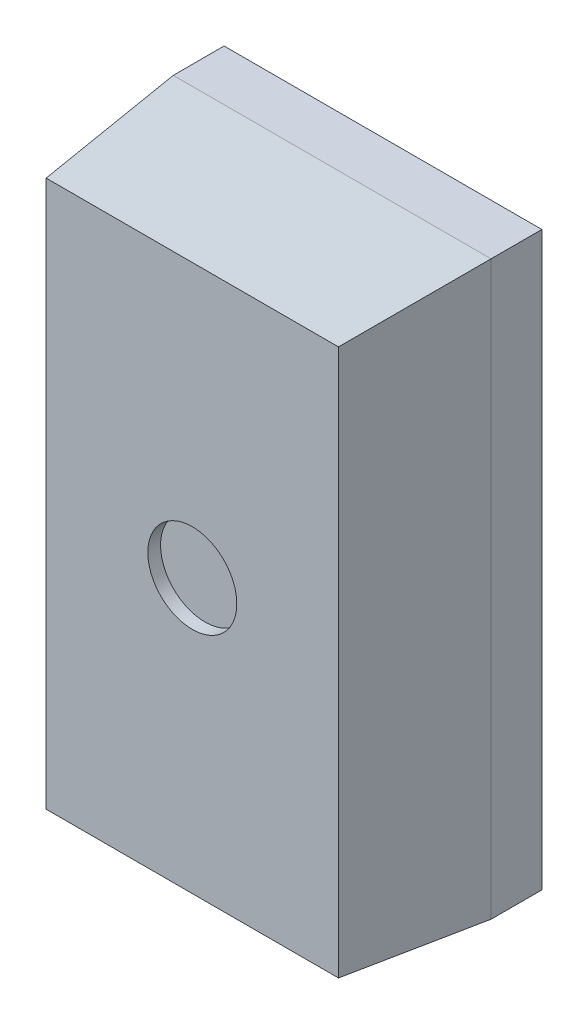
ISO-10303-21;
HEADER;
FILE_DESCRIPTION(('STEP AP214'),'2;1');
FILE_NAME('part.step','',(''),(''),'','','');
FILE_SCHEMA(('AUTOMOTIVE_DESIGN { 1 0 10303 214 1 1 1 1 }'));
ENDSEC;
DATA;
#1=APPLICATION_CONTEXT('core data for automotive mechanical design processes');
#2=APPLICATION_PROTOCOL_DEFINITION('international standard','automotive_design',2000,#1);
#3=PRODUCT_CONTEXT('',#1,'mechanical');
#4=PRODUCT('Part','Part','',(#3));
#5=PRODUCT_RELATED_PRODUCT_CATEGORY('part','',(#4));
#6=PRODUCT_DEFINITION_FORMATION('','',#4);
#7=PRODUCT_DEFINITION_CONTEXT('part definition',#1,'design');
#8=PRODUCT_DEFINITION('design','',#6,#7);
#9=PRODUCT_DEFINITION_SHAPE('','',#8);
#10=(LENGTH_UNIT() NAMED_UNIT(*) SI_UNIT(.MILLI.,.METRE.));
#11=(NAMED_UNIT(*) PLANE_ANGLE_UNIT() SI_UNIT($,.RADIAN.));
#12=(NAMED_UNIT(*) SI_UNIT($,.STERADIAN.) SOLID_ANGLE_UNIT());
#13=UNCERTAINTY_MEASURE_WITH_UNIT(LENGTH_MEASURE(1.E-05),#10,'distance_accuracy_value','');
#14=(GEOMETRIC_REPRESENTATION_CONTEXT(3) GLOBAL_UNCERTAINTY_ASSIGNED_CONTEXT((#13)) GLOBAL_UNIT_ASSIGNED_CONTEXT((#10,
#11,#12)) REPRESENTATION_CONTEXT('',''));
#15=CARTESIAN_POINT('',(0.,0.,0.));
#16=DIRECTION('',(0.,0.,1.));
#17=DIRECTION('',(1.,0.,0.));
#18=AXIS2_PLACEMENT_3D('',#15,#16,#17);
#19=CARTESIAN_POINT('',(0.,0.,1.42));
#20=DIRECTION('',(0.,0.,-1.));
#21=DIRECTION('',(-1.,0.,0.));
#22=AXIS2_PLACEMENT_3D('',#19,#20,#21);
#23=PLANE('',#22);
#24=CARTESIAN_POINT('',(0.,0.,1.42));
#25=DIRECTION('',(0.,0.,-1.));
#26=DIRECTION('',(-1.,0.,0.));
#27=AXIS2_PLACEMENT_3D('',#24,#25,#26);
#28=CIRCLE('',#27,0.35);
#29=CARTESIAN_POINT('',(-0.35,0.,1.42));
#30=VERTEX_POINT('',#29);
#31=EDGE_CURVE('E20',#30,#30,#28,.F.);
#32=ORIENTED_EDGE('',*,*,#31,.T.);
#33=EDGE_LOOP('',(#32));
#34=FACE_BOUND('',#33,.T.);
#35=ADVANCED_FACE('F17',(#34),#23,.F.);
#36=CARTESIAN_POINT('',(0.,0.,1.52));
#37=DIRECTION('',(0.,0.,-1.));
#38=DIRECTION('',(-1.,0.,0.));
#39=AXIS2_PLACEMENT_3D('',#36,#37,#38);
#40=CYLINDRICAL_SURFACE('',#39,0.35);
#41=CARTESIAN_POINT('',(0.,0.,1.52));
#42=DIRECTION('',(0.,0.,-1.));
#43=DIRECTION('',(-1.,0.,0.));
#44=AXIS2_PLACEMENT_3D('',#41,#42,#43);
#45=CIRCLE('',#44,0.35);
#46=CARTESIAN_POINT('',(-0.35,0.,1.52));
#47=VERTEX_POINT('',#46);
#48=EDGE_CURVE('E89',#47,#47,#45,.T.);
#49=ORIENTED_EDGE('',*,*,#48,.F.);
#50=EDGE_LOOP('',(#49));
#51=FACE_BOUND('',#50,.T.);
#52=ORIENTED_EDGE('',*,*,#31,.F.);
#53=EDGE_LOOP('',(#52));
#54=FACE_BOUND('',#53,.T.);
#55=ADVANCED_FACE('F104',(#51,#54),#40,.F.);
#56=CARTESIAN_POINT('',(0.,0.,1.52));
#57=DIRECTION('',(0.,0.,1.));
#58=DIRECTION('',(1.,0.,0.));
#59=AXIS2_PLACEMENT_3D('',#56,#57,#58);
#60=PLANE('',#59);
#61=ORIENTED_EDGE('',*,*,#48,.T.);
#62=EDGE_LOOP('',(#61));
#63=FACE_BOUND('',#62,.T.);
#64=DIRECTION('',(1.,0.,0.));
#65=VECTOR('',#64,1.);
#66=CARTESIAN_POINT('',(1.25,2.15000000000003,1.52));
#67=LINE('',#66,#65);
#68=CARTESIAN_POINT('',(1.15000000000001,2.15000000000001,1.52));
#69=VERTEX_POINT('',#68);
#70=CARTESIAN_POINT('',(-1.15000000000001,2.15000000000001,1.52));
#71=VERTEX_POINT('',#70);
#72=EDGE_CURVE('E67',#69,#71,#67,.F.);
#73=ORIENTED_EDGE('',*,*,#72,.T.);
#74=DIRECTION('',(0.,1.,0.));
#75=VECTOR('',#74,1.);
#76=CARTESIAN_POINT('',(-1.15000000000003,2.25,1.52));
#77=LINE('',#76,#75);
#78=CARTESIAN_POINT('',(-1.15000000000001,-2.15000000000001,1.52));
#79=VERTEX_POINT('',#78);
#80=EDGE_CURVE('E85',#71,#79,#77,.F.);
#81=ORIENTED_EDGE('',*,*,#80,.T.);
#82=DIRECTION('',(1.,0.,0.));
#83=VECTOR('',#82,1.);
#84=CARTESIAN_POINT('',(-1.25,-2.15000000000003,1.52));
#85=LINE('',#84,#83);
#86=CARTESIAN_POINT('',(1.15000000000001,-2.15000000000001,1.52));
#87=VERTEX_POINT('',#86);
#88=EDGE_CURVE('E81',#79,#87,#85,.T.);
#89=ORIENTED_EDGE('',*,*,#88,.T.);
#90=DIRECTION('',(0.,1.,0.));
#91=VECTOR('',#90,1.);
#92=CARTESIAN_POINT('',(1.15000000000003,-2.25,1.52));
#93=LINE('',#92,#91);
#94=EDGE_CURVE('E72',#87,#69,#93,.T.);
#95=ORIENTED_EDGE('',*,*,#94,.T.);
#96=EDGE_LOOP('',(#73,#81,#89,#95));
#97=FACE_BOUND('',#96,.T.);
#98=ADVANCED_FACE('F84',(#63,#97),#60,.T.);
#99=CARTESIAN_POINT('',(-1.25,-2.2,0.97));
#100=DIRECTION('',(0.,0.995893206467709,-0.0905357460424635));
#101=DIRECTION('',(0.,0.0905357460424635,0.995893206467709));
#102=AXIS2_PLACEMENT_3D('',#99,#100,#101);
#103=PLANE('',#102);
#104=DIRECTION('',(1.,0.,0.));
#105=VECTOR('',#104,1.);
#106=CARTESIAN_POINT('',(-1.25,-2.25,0.42));
#107=LINE('',#106,#105);
#108=CARTESIAN_POINT('',(-1.24999999999999,-2.24999999999998,0.419999999999998));
#109=VERTEX_POINT('',#108);
#110=CARTESIAN_POINT('',(1.25,-2.24999999999998,0.419999999999998));
#111=VERTEX_POINT('',#110);
#112=EDGE_CURVE('E92',#109,#111,#107,.T.);
#113=ORIENTED_EDGE('',*,*,#112,.T.);
#114=DIRECTION('',(-0.0901669634666883,0.0901669634667435,0.99183659813418));
#115=VECTOR('',#114,1.);
#116=CARTESIAN_POINT('',(1.24999999999997,-2.25,0.419999999999997));
#117=LINE('',#116,#115);
#118=EDGE_CURVE('E77',#111,#87,#117,.T.);
#119=ORIENTED_EDGE('',*,*,#118,.T.);
#120=ORIENTED_EDGE('',*,*,#88,.F.);
#121=DIRECTION('',(-0.0901669634666883,-0.0901669634667435,-0.99183659813418));
#122=VECTOR('',#121,1.);
#123=CARTESIAN_POINT('',(-1.15000000000003,-2.15,1.52));
#124=LINE('',#123,#122);
#125=EDGE_CURVE('E246',#79,#109,#124,.T.);
#126=ORIENTED_EDGE('',*,*,#125,.T.);
#127=EDGE_LOOP('',(#113,#119,#120,#126));
#128=FACE_BOUND('',#127,.T.);
#129=ADVANCED_FACE('F91',(#128),#103,.F.);
#130=CARTESIAN_POINT('',(1.2,-2.25,0.97));
#131=DIRECTION('',(-0.995893206467709,0.,-0.0905357460424635));
#132=DIRECTION('',(-0.0905357460424635,0.,0.995893206467709));
#133=AXIS2_PLACEMENT_3D('',#130,#131,#132);
#134=PLANE('',#133);
#135=DIRECTION('',(0.,1.,0.));
#136=VECTOR('',#135,1.);
#137=CARTESIAN_POINT('',(1.25,-2.25,0.42));
#138=LINE('',#137,#136);
#139=CARTESIAN_POINT('',(1.24999999999998,2.25,0.419999999999998));
#140=VERTEX_POINT('',#139);
#141=EDGE_CURVE('E239',#111,#140,#138,.T.);
#142=ORIENTED_EDGE('',*,*,#141,.T.);
#143=DIRECTION('',(-0.0901669634667432,-0.0901669634666887,0.99183659813418));
#144=VECTOR('',#143,1.);
#145=CARTESIAN_POINT('',(1.25,2.24999999999997,0.419999999999997));
#146=LINE('',#145,#144);
#147=EDGE_CURVE('E79',#140,#69,#146,.T.);
#148=ORIENTED_EDGE('',*,*,#147,.T.);
#149=ORIENTED_EDGE('',*,*,#94,.F.);
#150=ORIENTED_EDGE('',*,*,#118,.F.);
#151=EDGE_LOOP('',(#142,#148,#149,#150));
#152=FACE_BOUND('',#151,.T.);
#153=ADVANCED_FACE('F75',(#152),#134,.F.);
#154=CARTESIAN_POINT('',(1.25,2.2,0.97));
#155=DIRECTION('',(0.,-0.995893206467709,-0.0905357460424635));
#156=DIRECTION('',(0.,0.0905357460424635,-0.995893206467709));
#157=AXIS2_PLACEMENT_3D('',#154,#155,#156);
#158=PLANE('',#157);
#159=DIRECTION('',(1.,0.,0.));
#160=VECTOR('',#159,1.);
#161=CARTESIAN_POINT('',(1.25,2.25,0.42));
#162=LINE('',#161,#160);
#163=CARTESIAN_POINT('',(-1.25,2.24999999999998,0.419999999999998));
#164=VERTEX_POINT('',#163);
#165=EDGE_CURVE('E223',#140,#164,#162,.F.);
#166=ORIENTED_EDGE('',*,*,#165,.T.);
#167=DIRECTION('',(0.0901669634666883,-0.0901669634667435,0.99183659813418));
#168=VECTOR('',#167,1.);
#169=CARTESIAN_POINT('',(-1.24999999999997,2.25,0.419999999999997));
#170=LINE('',#169,#168);
#171=EDGE_CURVE('E224',#164,#71,#170,.T.);
#172=ORIENTED_EDGE('',*,*,#171,.T.);
#173=ORIENTED_EDGE('',*,*,#72,.F.);
#174=ORIENTED_EDGE('',*,*,#147,.F.);
#175=EDGE_LOOP('',(#166,#172,#173,#174));
#176=FACE_BOUND('',#175,.T.);
#177=ADVANCED_FACE('F139',(#176),#158,.F.);
#178=CARTESIAN_POINT('',(-1.2,2.25,0.97));
#179=DIRECTION('',(0.995893206467709,0.,-0.0905357460424635));
#180=DIRECTION('',(-0.0905357460424635,0.,-0.995893206467709));
#181=AXIS2_PLACEMENT_3D('',#178,#179,#180);
#182=PLANE('',#181);
#183=DIRECTION('',(0.,1.,0.));
#184=VECTOR('',#183,1.);
#185=CARTESIAN_POINT('',(-1.25,2.25,0.42));
#186=LINE('',#185,#184);
#187=EDGE_CURVE('E230',#164,#109,#186,.F.);
#188=ORIENTED_EDGE('',*,*,#187,.T.);
#189=ORIENTED_EDGE('',*,*,#125,.F.);
#190=ORIENTED_EDGE('',*,*,#80,.F.);
#191=ORIENTED_EDGE('',*,*,#171,.F.);
#192=EDGE_LOOP('',(#188,#189,#190,#191));
#193=FACE_BOUND('',#192,.T.);
#194=ADVANCED_FACE('F135',(#193),#182,.F.);
#195=CARTESIAN_POINT('',(-1.25,-2.25,0.02));
#196=DIRECTION('',(0.,1.,0.));
#197=DIRECTION('',(0.,0.,1.));
#198=AXIS2_PLACEMENT_3D('',#195,#196,#197);
#199=PLANE('',#198);
#200=DIRECTION('',(0.,0.,1.));
#201=VECTOR('',#200,1.);
#202=CARTESIAN_POINT('',(1.25,-2.25,0.02));
#203=LINE('',#202,#201);
#204=CARTESIAN_POINT('',(1.25,-2.25,0.02));
#205=VERTEX_POINT('',#204);
#206=EDGE_CURVE('E241',#205,#111,#203,.T.);
#207=ORIENTED_EDGE('',*,*,#206,.T.);
#208=ORIENTED_EDGE('',*,*,#112,.F.);
#209=DIRECTION('',(0.,0.,-1.));
#210=VECTOR('',#209,1.);
#211=CARTESIAN_POINT('',(-1.25,-2.25,0.02));
#212=LINE('',#211,#210);
#213=CARTESIAN_POINT('',(-1.25,-2.25,0.02));
#214=VERTEX_POINT('',#213);
#215=EDGE_CURVE('E232',#109,#214,#212,.T.);
#216=ORIENTED_EDGE('',*,*,#215,.T.);
#217=DIRECTION('',(1.,0.,0.));
#218=VECTOR('',#217,1.);
#219=CARTESIAN_POINT('',(0.,-2.25,0.02));
#220=LINE('',#219,#218);
#221=EDGE_CURVE('E249',#214,#205,#220,.T.);
#222=ORIENTED_EDGE('',*,*,#221,.T.);
#223=EDGE_LOOP('',(#207,#208,#216,#222));
#224=FACE_BOUND('',#223,.T.);
#225=ADVANCED_FACE('F131',(#224),#199,.F.);
#226=CARTESIAN_POINT('',(1.25,-2.25,0.02));
#227=DIRECTION('',(-1.,0.,0.));
#228=DIRECTION('',(0.,0.,1.));
#229=AXIS2_PLACEMENT_3D('',#226,#227,#228);
#230=PLANE('',#229);
#231=DIRECTION('',(0.,0.,-1.));
#232=VECTOR('',#231,1.);
#233=CARTESIAN_POINT('',(1.25,2.25,0.02));
#234=LINE('',#233,#232);
#235=CARTESIAN_POINT('',(1.25,2.25,0.02));
#236=VERTEX_POINT('',#235);
#237=EDGE_CURVE('E226',#236,#140,#234,.F.);
#238=ORIENTED_EDGE('',*,*,#237,.T.);
#239=ORIENTED_EDGE('',*,*,#141,.F.);
#240=ORIENTED_EDGE('',*,*,#206,.F.);
#241=DIRECTION('',(0.,1.,0.));
#242=VECTOR('',#241,1.);
#243=CARTESIAN_POINT('',(1.25,0.,0.02));
#244=LINE('',#243,#242);
#245=EDGE_CURVE('E252',#205,#236,#244,.T.);
#246=ORIENTED_EDGE('',*,*,#245,.T.);
#247=EDGE_LOOP('',(#238,#239,#240,#246));
#248=FACE_BOUND('',#247,.T.);
#249=ADVANCED_FACE('F127',(#248),#230,.F.);
#250=CARTESIAN_POINT('',(1.25,2.25,0.02));
#251=DIRECTION('',(0.,-1.,0.));
#252=DIRECTION('',(0.,0.,-1.));
#253=AXIS2_PLACEMENT_3D('',#250,#251,#252);
#254=PLANE('',#253);
#255=DIRECTION('',(0.,0.,-1.));
#256=VECTOR('',#255,1.);
#257=CARTESIAN_POINT('',(-1.25,2.25,0.02));
#258=LINE('',#257,#256);
#259=CARTESIAN_POINT('',(-1.25,2.25,0.02));
#260=VERTEX_POINT('',#259);
#261=EDGE_CURVE('E34',#260,#164,#258,.F.);
#262=ORIENTED_EDGE('',*,*,#261,.T.);
#263=ORIENTED_EDGE('',*,*,#165,.F.);
#264=ORIENTED_EDGE('',*,*,#237,.F.);
#265=DIRECTION('',(1.,0.,0.));
#266=VECTOR('',#265,1.);
#267=CARTESIAN_POINT('',(0.,2.25,0.02));
#268=LINE('',#267,#266);
#269=EDGE_CURVE('E26',#236,#260,#268,.F.);
#270=ORIENTED_EDGE('',*,*,#269,.T.);
#271=EDGE_LOOP('',(#262,#263,#264,#270));
#272=FACE_BOUND('',#271,.T.);
#273=ADVANCED_FACE('F121',(#272),#254,.F.);
#274=CARTESIAN_POINT('',(-1.25,2.25,0.02));
#275=DIRECTION('',(1.,0.,0.));
#276=DIRECTION('',(0.,0.,-1.));
#277=AXIS2_PLACEMENT_3D('',#274,#275,#276);
#278=PLANE('',#277);
#279=ORIENTED_EDGE('',*,*,#215,.F.);
#280=ORIENTED_EDGE('',*,*,#187,.F.);
#281=ORIENTED_EDGE('',*,*,#261,.F.);
#282=DIRECTION('',(0.,1.,0.));
#283=VECTOR('',#282,1.);
#284=CARTESIAN_POINT('',(-1.25,0.,0.02));
#285=LINE('',#284,#283);
#286=EDGE_CURVE('E11',#260,#214,#285,.F.);
#287=ORIENTED_EDGE('',*,*,#286,.T.);
#288=EDGE_LOOP('',(#279,#280,#281,#287));
#289=FACE_BOUND('',#288,.T.);
#290=ADVANCED_FACE('F115',(#289),#278,.F.);
#291=CARTESIAN_POINT('',(0.,0.,0.02));
#292=DIRECTION('',(0.,0.,1.));
#293=DIRECTION('',(1.,0.,0.));
#294=AXIS2_PLACEMENT_3D('',#291,#292,#293);
#295=PLANE('',#294);
#296=ORIENTED_EDGE('',*,*,#269,.F.);
#297=ORIENTED_EDGE('',*,*,#245,.F.);
#298=ORIENTED_EDGE('',*,*,#221,.F.);
#299=ORIENTED_EDGE('',*,*,#286,.F.);
#300=EDGE_LOOP('',(#296,#297,#298,#299));
#301=FACE_BOUND('',#300,.T.);
#302=ADVANCED_FACE('F113',(#301),#295,.F.);
#303=CLOSED_SHELL('',(#35,#55,#98,#129,#153,#177,#194,#225,#249,#273,#290,#302));
#304=MANIFOLD_SOLID_BREP('B1',#303);
#305=ADVANCED_BREP_SHAPE_REPRESENTATION('',(#18,#304),#14);
#306=SHAPE_DEFINITION_REPRESENTATION(#9,#305);
ENDSEC;
END-ISO-10303-21;
